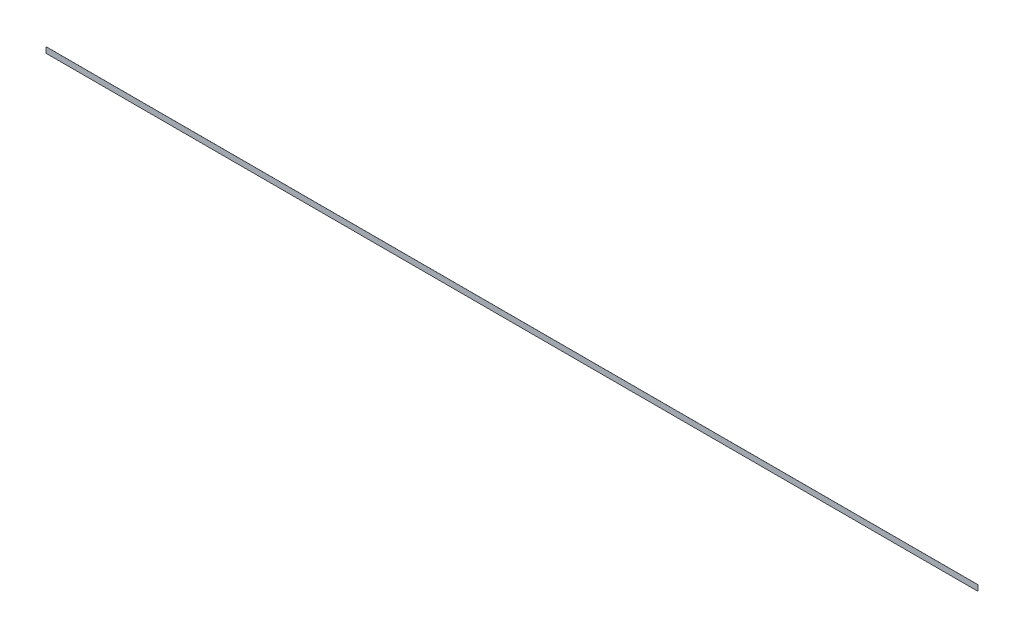
ISO-10303-21;
HEADER;
FILE_DESCRIPTION(('STEP AP214'),'2;1');
FILE_NAME('part.step','',(''),(''),'','','');
FILE_SCHEMA(('AUTOMOTIVE_DESIGN { 1 0 10303 214 1 1 1 1 }'));
ENDSEC;
DATA;
#1=APPLICATION_CONTEXT('core data for automotive mechanical design processes');
#2=APPLICATION_PROTOCOL_DEFINITION('international standard','automotive_design',2000,#1);
#3=PRODUCT_CONTEXT('',#1,'mechanical');
#4=PRODUCT('Part','Part','',(#3));
#5=PRODUCT_RELATED_PRODUCT_CATEGORY('part','',(#4));
#6=PRODUCT_DEFINITION_FORMATION('','',#4);
#7=PRODUCT_DEFINITION_CONTEXT('part definition',#1,'design');
#8=PRODUCT_DEFINITION('design','',#6,#7);
#9=PRODUCT_DEFINITION_SHAPE('','',#8);
#10=(LENGTH_UNIT() NAMED_UNIT(*) SI_UNIT(.MILLI.,.METRE.));
#11=(NAMED_UNIT(*) PLANE_ANGLE_UNIT() SI_UNIT($,.RADIAN.));
#12=(NAMED_UNIT(*) SI_UNIT($,.STERADIAN.) SOLID_ANGLE_UNIT());
#13=UNCERTAINTY_MEASURE_WITH_UNIT(LENGTH_MEASURE(1.E-05),#10,'distance_accuracy_value','');
#14=(GEOMETRIC_REPRESENTATION_CONTEXT(3) GLOBAL_UNCERTAINTY_ASSIGNED_CONTEXT((#13)) GLOBAL_UNIT_ASSIGNED_CONTEXT((#10,
#11,#12)) REPRESENTATION_CONTEXT('',''));
#15=CARTESIAN_POINT('',(0.,0.,0.));
#16=DIRECTION('',(0.,0.,1.));
#17=DIRECTION('',(1.,0.,0.));
#18=AXIS2_PLACEMENT_3D('',#15,#16,#17);
#19=CARTESIAN_POINT('',(-4114.8,-279.4,0.));
#20=DIRECTION('',(0.,0.,1.));
#21=DIRECTION('',(1.,0.,0.));
#22=AXIS2_PLACEMENT_3D('',#19,#20,#21);
#23=PLANE('',#22);
#24=DIRECTION('',(1.,0.,0.));
#25=VECTOR('',#24,1.);
#26=CARTESIAN_POINT('',(-4114.8,-304.8,0.));
#27=LINE('',#26,#25);
#28=CARTESIAN_POINT('',(-8229.6,-304.8,0.));
#29=VERTEX_POINT('',#28);
#30=CARTESIAN_POINT('',(0.,-304.8,0.));
#31=VERTEX_POINT('',#30);
#32=EDGE_CURVE('E76',#29,#31,#27,.T.);
#33=ORIENTED_EDGE('',*,*,#32,.F.);
#34=DIRECTION('',(0.,1.,0.));
#35=VECTOR('',#34,1.);
#36=CARTESIAN_POINT('',(-8229.6,-279.4,0.));
#37=LINE('',#36,#35);
#38=CARTESIAN_POINT('',(-8229.6,-254.,0.));
#39=VERTEX_POINT('',#38);
#40=EDGE_CURVE('E65',#29,#39,#37,.T.);
#41=ORIENTED_EDGE('',*,*,#40,.T.);
#42=DIRECTION('',(1.,0.,0.));
#43=VECTOR('',#42,1.);
#44=CARTESIAN_POINT('',(-4114.8,-254.,0.));
#45=LINE('',#44,#43);
#46=CARTESIAN_POINT('',(0.,-254.,0.));
#47=VERTEX_POINT('',#46);
#48=EDGE_CURVE('E53',#39,#47,#45,.T.);
#49=ORIENTED_EDGE('',*,*,#48,.T.);
#50=DIRECTION('',(0.,1.,0.));
#51=VECTOR('',#50,1.);
#52=CARTESIAN_POINT('',(0.,-279.4,0.));
#53=LINE('',#52,#51);
#54=EDGE_CURVE('E17',#31,#47,#53,.T.);
#55=ORIENTED_EDGE('',*,*,#54,.F.);
#56=EDGE_LOOP('',(#33,#41,#49,#55));
#57=FACE_BOUND('',#56,.T.);
#58=ADVANCED_FACE('F14',(#57),#23,.F.);
#59=CARTESIAN_POINT('',(0.,-279.4,0.396875));
#60=DIRECTION('',(1.,0.,0.));
#61=DIRECTION('',(0.,0.,-1.));
#62=AXIS2_PLACEMENT_3D('',#59,#60,#61);
#63=PLANE('',#62);
#64=DIRECTION('',(0.,1.,0.));
#65=VECTOR('',#64,1.);
#66=CARTESIAN_POINT('',(0.,-279.4,0.396875));
#67=LINE('',#66,#65);
#68=CARTESIAN_POINT('',(0.,-304.8,0.396875));
#69=VERTEX_POINT('',#68);
#70=CARTESIAN_POINT('',(0.,-254.,0.396875));
#71=VERTEX_POINT('',#70);
#72=EDGE_CURVE('E80',#69,#71,#67,.T.);
#73=ORIENTED_EDGE('',*,*,#72,.F.);
#74=DIRECTION('',(0.,0.,1.));
#75=VECTOR('',#74,1.);
#76=CARTESIAN_POINT('',(0.,-304.799999999999,0.396875));
#77=LINE('',#76,#75);
#78=EDGE_CURVE('E62',#31,#69,#77,.T.);
#79=ORIENTED_EDGE('',*,*,#78,.F.);
#80=ORIENTED_EDGE('',*,*,#54,.T.);
#81=DIRECTION('',(0.,0.,1.));
#82=VECTOR('',#81,1.);
#83=CARTESIAN_POINT('',(0.,-254.,0.396875));
#84=LINE('',#83,#82);
#85=EDGE_CURVE('E59',#47,#71,#84,.T.);
#86=ORIENTED_EDGE('',*,*,#85,.T.);
#87=EDGE_LOOP('',(#73,#79,#80,#86));
#88=FACE_BOUND('',#87,.T.);
#89=ADVANCED_FACE('F58',(#88),#63,.T.);
#90=CARTESIAN_POINT('',(-4114.8,-254.,0.396875));
#91=DIRECTION('',(0.,-1.,0.));
#92=DIRECTION('',(1.,0.,0.));
#93=AXIS2_PLACEMENT_3D('',#90,#91,#92);
#94=PLANE('',#93);
#95=DIRECTION('',(0.,0.,-1.));
#96=VECTOR('',#95,1.);
#97=CARTESIAN_POINT('',(-8229.6,-254.,0.396875));
#98=LINE('',#97,#96);
#99=CARTESIAN_POINT('',(-8229.6,-254.,0.396875));
#100=VERTEX_POINT('',#99);
#101=EDGE_CURVE('E67',#39,#100,#98,.F.);
#102=ORIENTED_EDGE('',*,*,#101,.T.);
#103=DIRECTION('',(1.,0.,0.));
#104=VECTOR('',#103,1.);
#105=CARTESIAN_POINT('',(-4114.8,-254.,0.396875));
#106=LINE('',#105,#104);
#107=EDGE_CURVE('E71',#71,#100,#106,.F.);
#108=ORIENTED_EDGE('',*,*,#107,.F.);
#109=ORIENTED_EDGE('',*,*,#85,.F.);
#110=ORIENTED_EDGE('',*,*,#48,.F.);
#111=EDGE_LOOP('',(#102,#108,#109,#110));
#112=FACE_BOUND('',#111,.T.);
#113=ADVANCED_FACE('F69',(#112),#94,.F.);
#114=CARTESIAN_POINT('',(-8229.6,-279.4,0.396875));
#115=DIRECTION('',(1.,0.,0.));
#116=DIRECTION('',(0.,0.,-1.));
#117=AXIS2_PLACEMENT_3D('',#114,#115,#116);
#118=PLANE('',#117);
#119=DIRECTION('',(0.,0.,1.));
#120=VECTOR('',#119,1.);
#121=CARTESIAN_POINT('',(-8229.6,-304.800000000001,0.396875));
#122=LINE('',#121,#120);
#123=CARTESIAN_POINT('',(-8229.6,-304.8,0.396875));
#124=VERTEX_POINT('',#123);
#125=EDGE_CURVE('E32',#124,#29,#122,.F.);
#126=ORIENTED_EDGE('',*,*,#125,.F.);
#127=DIRECTION('',(0.,1.,0.));
#128=VECTOR('',#127,1.);
#129=CARTESIAN_POINT('',(-8229.6,-279.4,0.396875));
#130=LINE('',#129,#128);
#131=EDGE_CURVE('E23',#100,#124,#130,.F.);
#132=ORIENTED_EDGE('',*,*,#131,.F.);
#133=ORIENTED_EDGE('',*,*,#101,.F.);
#134=ORIENTED_EDGE('',*,*,#40,.F.);
#135=EDGE_LOOP('',(#126,#132,#133,#134));
#136=FACE_BOUND('',#135,.T.);
#137=ADVANCED_FACE('F86',(#136),#118,.F.);
#138=CARTESIAN_POINT('',(-4114.8,-304.8,0.396875));
#139=DIRECTION('',(0.,-1.,0.));
#140=DIRECTION('',(1.,0.,0.));
#141=AXIS2_PLACEMENT_3D('',#138,#139,#140);
#142=PLANE('',#141);
#143=DIRECTION('',(1.,0.,0.));
#144=VECTOR('',#143,1.);
#145=CARTESIAN_POINT('',(-4114.8,-304.8,0.396875));
#146=LINE('',#145,#144);
#147=EDGE_CURVE('E9',#124,#69,#146,.T.);
#148=ORIENTED_EDGE('',*,*,#147,.F.);
#149=ORIENTED_EDGE('',*,*,#125,.T.);
#150=ORIENTED_EDGE('',*,*,#32,.T.);
#151=ORIENTED_EDGE('',*,*,#78,.T.);
#152=EDGE_LOOP('',(#148,#149,#150,#151));
#153=FACE_BOUND('',#152,.T.);
#154=ADVANCED_FACE('F88',(#153),#142,.T.);
#155=CARTESIAN_POINT('',(-4114.8,-279.4,0.396875));
#156=DIRECTION('',(0.,0.,1.));
#157=DIRECTION('',(1.,0.,0.));
#158=AXIS2_PLACEMENT_3D('',#155,#156,#157);
#159=PLANE('',#158);
#160=ORIENTED_EDGE('',*,*,#131,.T.);
#161=ORIENTED_EDGE('',*,*,#147,.T.);
#162=ORIENTED_EDGE('',*,*,#72,.T.);
#163=ORIENTED_EDGE('',*,*,#107,.T.);
#164=EDGE_LOOP('',(#160,#161,#162,#163));
#165=FACE_BOUND('',#164,.T.);
#166=ADVANCED_FACE('F85',(#165),#159,.T.);
#167=CLOSED_SHELL('',(#58,#89,#113,#137,#154,#166));
#168=MANIFOLD_SOLID_BREP('B1',#167);
#169=ADVANCED_BREP_SHAPE_REPRESENTATION('',(#18,#168),#14);
#170=SHAPE_DEFINITION_REPRESENTATION(#9,#169);
ENDSEC;
END-ISO-10303-21;
